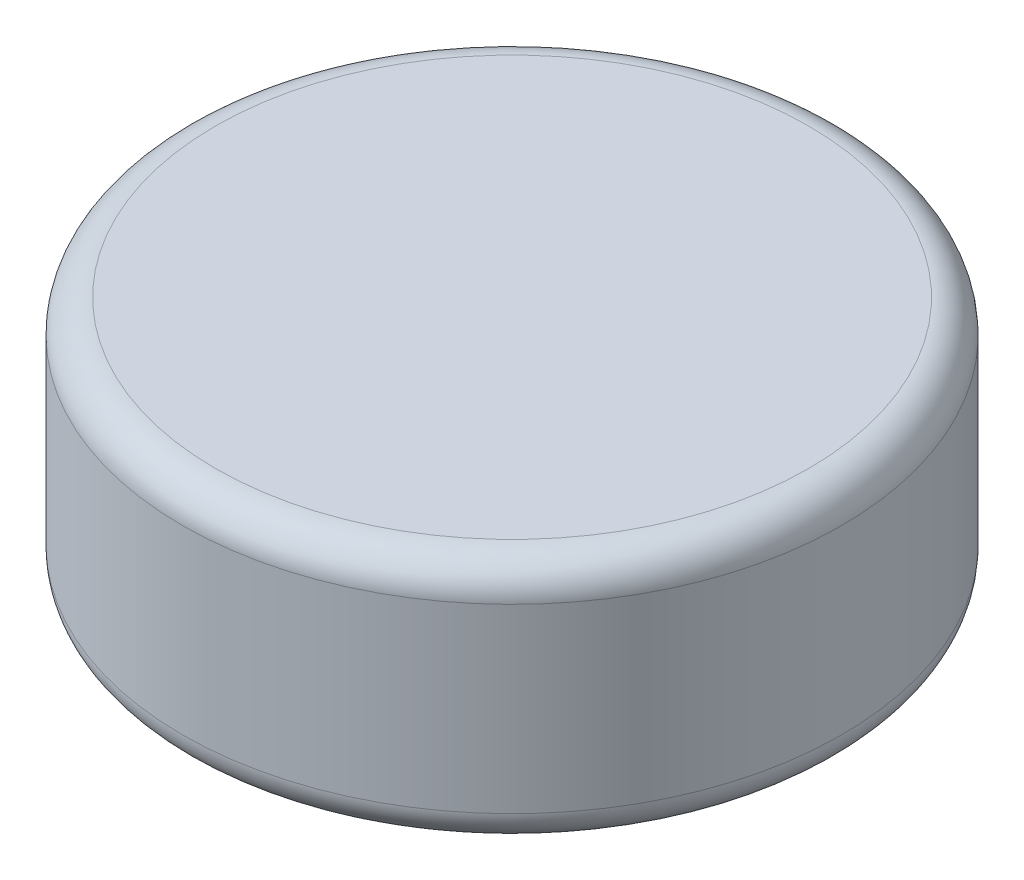
ISO-10303-21;
HEADER;
FILE_DESCRIPTION(('STEP AP214'),'2;1');
FILE_NAME('part.step','',(''),(''),'','','');
FILE_SCHEMA(('AUTOMOTIVE_DESIGN { 1 0 10303 214 1 1 1 1 }'));
ENDSEC;
DATA;
#1=APPLICATION_CONTEXT('core data for automotive mechanical design processes');
#2=APPLICATION_PROTOCOL_DEFINITION('international standard','automotive_design',2000,#1);
#3=PRODUCT_CONTEXT('',#1,'mechanical');
#4=PRODUCT('Part','Part','',(#3));
#5=PRODUCT_RELATED_PRODUCT_CATEGORY('part','',(#4));
#6=PRODUCT_DEFINITION_FORMATION('','',#4);
#7=PRODUCT_DEFINITION_CONTEXT('part definition',#1,'design');
#8=PRODUCT_DEFINITION('design','',#6,#7);
#9=PRODUCT_DEFINITION_SHAPE('','',#8);
#10=(LENGTH_UNIT() NAMED_UNIT(*) SI_UNIT(.MILLI.,.METRE.));
#11=(NAMED_UNIT(*) PLANE_ANGLE_UNIT() SI_UNIT($,.RADIAN.));
#12=(NAMED_UNIT(*) SI_UNIT($,.STERADIAN.) SOLID_ANGLE_UNIT());
#13=UNCERTAINTY_MEASURE_WITH_UNIT(LENGTH_MEASURE(1.E-05),#10,'distance_accuracy_value','');
#14=(GEOMETRIC_REPRESENTATION_CONTEXT(3) GLOBAL_UNCERTAINTY_ASSIGNED_CONTEXT((#13)) GLOBAL_UNIT_ASSIGNED_CONTEXT((#10,
#11,#12)) REPRESENTATION_CONTEXT('',''));
#15=CARTESIAN_POINT('',(0.,0.,0.));
#16=DIRECTION('',(0.,0.,1.));
#17=DIRECTION('',(1.,0.,0.));
#18=AXIS2_PLACEMENT_3D('',#15,#16,#17);
#19=CARTESIAN_POINT('',(0.,1.5,0.));
#20=DIRECTION('',(0.,-1.,0.));
#21=DIRECTION('',(0.,0.,-1.));
#22=AXIS2_PLACEMENT_3D('',#19,#20,#21);
#23=CYLINDRICAL_SURFACE('',#22,2.);
#24=CARTESIAN_POINT('',(0.,0.2,0.));
#25=DIRECTION('',(0.,1.,0.));
#26=DIRECTION('',(0.,0.,1.));
#27=AXIS2_PLACEMENT_3D('',#24,#25,#26);
#28=CIRCLE('',#27,2.);
#29=CARTESIAN_POINT('',(0.,0.2,2.));
#30=VERTEX_POINT('',#29);
#31=EDGE_CURVE('E49',#30,#30,#28,.T.);
#32=ORIENTED_EDGE('',*,*,#31,.T.);
#33=EDGE_LOOP('',(#32));
#34=FACE_BOUND('',#33,.T.);
#35=CARTESIAN_POINT('',(0.,1.3,0.));
#36=DIRECTION('',(0.,1.,0.));
#37=DIRECTION('',(0.,0.,1.));
#38=AXIS2_PLACEMENT_3D('',#35,#36,#37);
#39=CIRCLE('',#38,2.);
#40=CARTESIAN_POINT('',(0.,1.3,2.));
#41=VERTEX_POINT('',#40);
#42=EDGE_CURVE('E54',#41,#41,#39,.F.);
#43=ORIENTED_EDGE('',*,*,#42,.T.);
#44=EDGE_LOOP('',(#43));
#45=FACE_BOUND('',#44,.T.);
#46=ADVANCED_FACE('F36',(#34,#45),#23,.T.);
#47=CARTESIAN_POINT('',(0.,1.5,0.));
#48=DIRECTION('',(0.,1.,0.));
#49=DIRECTION('',(0.,0.,1.));
#50=AXIS2_PLACEMENT_3D('',#47,#48,#49);
#51=PLANE('',#50);
#52=CARTESIAN_POINT('',(0.,1.5,0.));
#53=DIRECTION('',(0.,1.,0.));
#54=DIRECTION('',(0.,0.,1.));
#55=AXIS2_PLACEMENT_3D('',#52,#53,#54);
#56=CIRCLE('',#55,1.8);
#57=CARTESIAN_POINT('',(0.,1.5,1.8));
#58=VERTEX_POINT('',#57);
#59=EDGE_CURVE('E10',#58,#58,#56,.T.);
#60=ORIENTED_EDGE('',*,*,#59,.T.);
#61=EDGE_LOOP('',(#60));
#62=FACE_BOUND('',#61,.T.);
#63=ADVANCED_FACE('F71',(#62),#51,.T.);
#64=CARTESIAN_POINT('',(0.,0.,0.));
#65=DIRECTION('',(0.,1.,0.));
#66=DIRECTION('',(0.,0.,1.));
#67=AXIS2_PLACEMENT_3D('',#64,#65,#66);
#68=PLANE('',#67);
#69=CARTESIAN_POINT('',(0.,0.,0.));
#70=DIRECTION('',(0.,1.,0.));
#71=DIRECTION('',(0.,0.,1.));
#72=AXIS2_PLACEMENT_3D('',#69,#70,#71);
#73=CIRCLE('',#72,1.8);
#74=CARTESIAN_POINT('',(0.,0.,1.8));
#75=VERTEX_POINT('',#74);
#76=EDGE_CURVE('E44',#75,#75,#73,.F.);
#77=ORIENTED_EDGE('',*,*,#76,.T.);
#78=EDGE_LOOP('',(#77));
#79=FACE_BOUND('',#78,.T.);
#80=ADVANCED_FACE('F68',(#79),#68,.F.);
#81=CARTESIAN_POINT('',(0.,0.2,0.));
#82=DIRECTION('',(0.,1.,0.));
#83=DIRECTION('',(0.,0.,1.));
#84=AXIS2_PLACEMENT_3D('',#81,#82,#83);
#85=TOROIDAL_SURFACE('',#84,1.8,0.2);
#86=ORIENTED_EDGE('',*,*,#76,.F.);
#87=EDGE_LOOP('',(#86));
#88=FACE_BOUND('',#87,.T.);
#89=ORIENTED_EDGE('',*,*,#31,.F.);
#90=EDGE_LOOP('',(#89));
#91=FACE_BOUND('',#90,.T.);
#92=ADVANCED_FACE('F64',(#88,#91),#85,.T.);
#93=CARTESIAN_POINT('',(0.,1.3,0.));
#94=DIRECTION('',(0.,1.,0.));
#95=DIRECTION('',(0.,0.,1.));
#96=AXIS2_PLACEMENT_3D('',#93,#94,#95);
#97=TOROIDAL_SURFACE('',#96,1.8,0.2);
#98=ORIENTED_EDGE('',*,*,#42,.F.);
#99=EDGE_LOOP('',(#98));
#100=FACE_BOUND('',#99,.T.);
#101=ORIENTED_EDGE('',*,*,#59,.F.);
#102=EDGE_LOOP('',(#101));
#103=FACE_BOUND('',#102,.T.);
#104=ADVANCED_FACE('F38',(#100,#103),#97,.T.);
#105=CLOSED_SHELL('',(#46,#63,#80,#92,#104));
#106=MANIFOLD_SOLID_BREP('B2',#105);
#107=ADVANCED_BREP_SHAPE_REPRESENTATION('',(#18,#106),#14);
#108=SHAPE_DEFINITION_REPRESENTATION(#9,#107);
ENDSEC;
END-ISO-10303-21;
